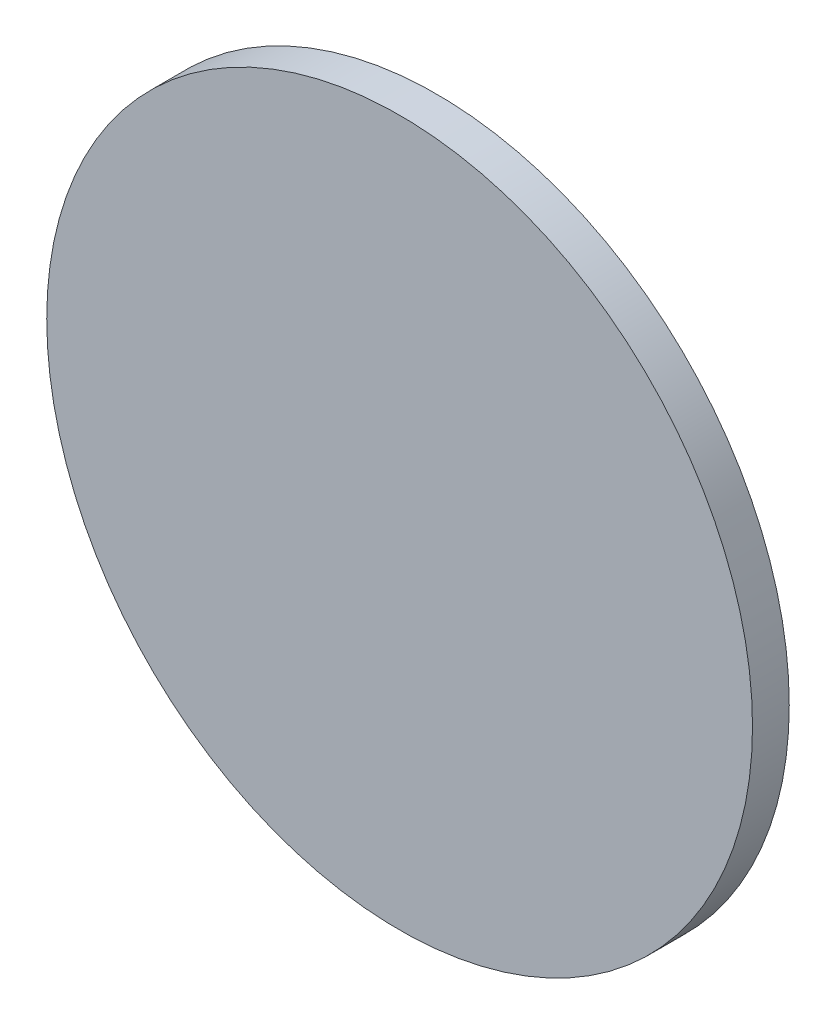
ISO-10303-21;
HEADER;
FILE_DESCRIPTION(('STEP AP214'),'2;1');
FILE_NAME('part.step','',(''),(''),'','','');
FILE_SCHEMA(('AUTOMOTIVE_DESIGN { 1 0 10303 214 1 1 1 1 }'));
ENDSEC;
DATA;
#1=APPLICATION_CONTEXT('core data for automotive mechanical design processes');
#2=APPLICATION_PROTOCOL_DEFINITION('international standard','automotive_design',2000,#1);
#3=PRODUCT_CONTEXT('',#1,'mechanical');
#4=PRODUCT('Part','Part','',(#3));
#5=PRODUCT_RELATED_PRODUCT_CATEGORY('part','',(#4));
#6=PRODUCT_DEFINITION_FORMATION('','',#4);
#7=PRODUCT_DEFINITION_CONTEXT('part definition',#1,'design');
#8=PRODUCT_DEFINITION('design','',#6,#7);
#9=PRODUCT_DEFINITION_SHAPE('','',#8);
#10=(LENGTH_UNIT() NAMED_UNIT(*) SI_UNIT(.MILLI.,.METRE.));
#11=(NAMED_UNIT(*) PLANE_ANGLE_UNIT() SI_UNIT($,.RADIAN.));
#12=(NAMED_UNIT(*) SI_UNIT($,.STERADIAN.) SOLID_ANGLE_UNIT());
#13=UNCERTAINTY_MEASURE_WITH_UNIT(LENGTH_MEASURE(1.E-05),#10,'distance_accuracy_value','');
#14=(GEOMETRIC_REPRESENTATION_CONTEXT(3) GLOBAL_UNCERTAINTY_ASSIGNED_CONTEXT((#13)) GLOBAL_UNIT_ASSIGNED_CONTEXT((#10,
#11,#12)) REPRESENTATION_CONTEXT('',''));
#15=CARTESIAN_POINT('',(0.,0.,0.));
#16=DIRECTION('',(0.,0.,1.));
#17=DIRECTION('',(1.,0.,0.));
#18=AXIS2_PLACEMENT_3D('',#15,#16,#17);
#19=CARTESIAN_POINT('',(0.,0.,10.));
#20=DIRECTION('',(0.,0.,-1.));
#21=DIRECTION('',(-1.,0.,0.));
#22=AXIS2_PLACEMENT_3D('',#19,#20,#21);
#23=CYLINDRICAL_SURFACE('',#22,96.);
#24=CARTESIAN_POINT('',(0.,0.,10.));
#25=DIRECTION('',(0.,0.,1.));
#26=DIRECTION('',(1.,0.,0.));
#27=AXIS2_PLACEMENT_3D('',#24,#25,#26);
#28=CIRCLE('',#27,96.);
#29=CARTESIAN_POINT('',(96.,0.,10.));
#30=VERTEX_POINT('',#29);
#31=EDGE_CURVE('E10',#30,#30,#28,.T.);
#32=ORIENTED_EDGE('',*,*,#31,.F.);
#33=EDGE_LOOP('',(#32));
#34=FACE_BOUND('',#33,.T.);
#35=CARTESIAN_POINT('',(0.,0.,0.));
#36=DIRECTION('',(0.,0.,1.));
#37=DIRECTION('',(1.,0.,0.));
#38=AXIS2_PLACEMENT_3D('',#35,#36,#37);
#39=CIRCLE('',#38,96.);
#40=CARTESIAN_POINT('',(96.,0.,0.));
#41=VERTEX_POINT('',#40);
#42=EDGE_CURVE('E34',#41,#41,#39,.T.);
#43=ORIENTED_EDGE('',*,*,#42,.T.);
#44=EDGE_LOOP('',(#43));
#45=FACE_BOUND('',#44,.T.);
#46=ADVANCED_FACE('F31',(#34,#45),#23,.T.);
#47=CARTESIAN_POINT('',(0.,0.,10.));
#48=DIRECTION('',(0.,0.,1.));
#49=DIRECTION('',(1.,0.,0.));
#50=AXIS2_PLACEMENT_3D('',#47,#48,#49);
#51=PLANE('',#50);
#52=ORIENTED_EDGE('',*,*,#31,.T.);
#53=EDGE_LOOP('',(#52));
#54=FACE_BOUND('',#53,.T.);
#55=ADVANCED_FACE('F46',(#54),#51,.T.);
#56=CARTESIAN_POINT('',(0.,0.,0.));
#57=DIRECTION('',(0.,0.,1.));
#58=DIRECTION('',(1.,0.,0.));
#59=AXIS2_PLACEMENT_3D('',#56,#57,#58);
#60=PLANE('',#59);
#61=ORIENTED_EDGE('',*,*,#42,.F.);
#62=EDGE_LOOP('',(#61));
#63=FACE_BOUND('',#62,.T.);
#64=ADVANCED_FACE('F44',(#63),#60,.F.);
#65=CLOSED_SHELL('',(#46,#55,#64));
#66=MANIFOLD_SOLID_BREP('B2',#65);
#67=ADVANCED_BREP_SHAPE_REPRESENTATION('',(#18,#66),#14);
#68=SHAPE_DEFINITION_REPRESENTATION(#9,#67);
ENDSEC;
END-ISO-10303-21;
